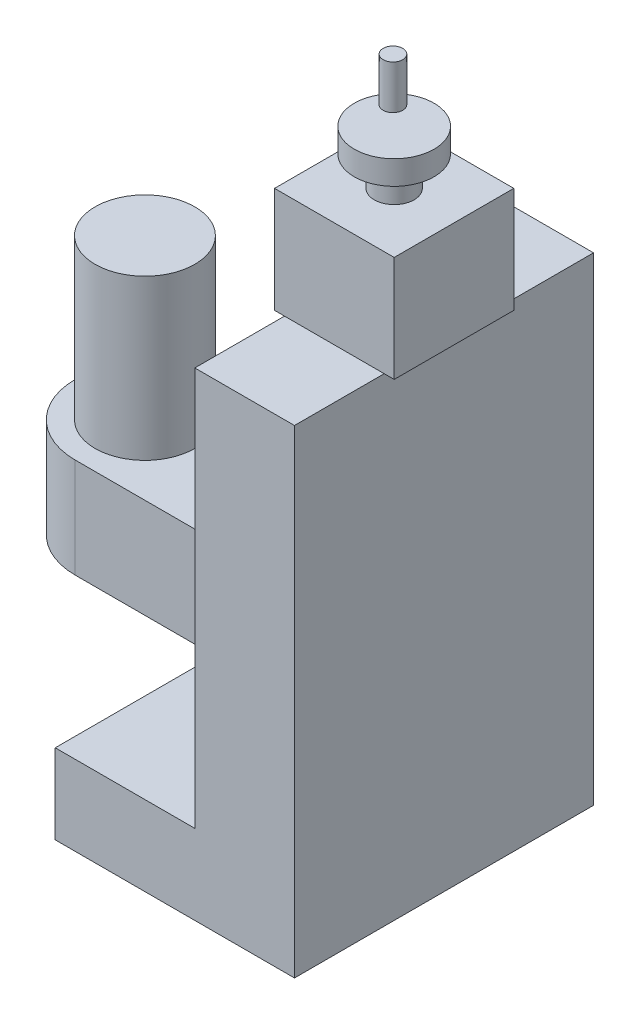
ISO-10303-21;
HEADER;
FILE_DESCRIPTION(('STEP AP214'),'2;1');
FILE_NAME('part.step','',(''),(''),'','','');
FILE_SCHEMA(('AUTOMOTIVE_DESIGN { 1 0 10303 214 1 1 1 1 }'));
ENDSEC;
DATA;
#1=APPLICATION_CONTEXT('core data for automotive mechanical design processes');
#2=APPLICATION_PROTOCOL_DEFINITION('international standard','automotive_design',2000,#1);
#3=PRODUCT_CONTEXT('',#1,'mechanical');
#4=PRODUCT('Part','Part','',(#3));
#5=PRODUCT_RELATED_PRODUCT_CATEGORY('part','',(#4));
#6=PRODUCT_DEFINITION_FORMATION('','',#4);
#7=PRODUCT_DEFINITION_CONTEXT('part definition',#1,'design');
#8=PRODUCT_DEFINITION('design','',#6,#7);
#9=PRODUCT_DEFINITION_SHAPE('','',#8);
#10=(LENGTH_UNIT() NAMED_UNIT(*) SI_UNIT(.MILLI.,.METRE.));
#11=(NAMED_UNIT(*) PLANE_ANGLE_UNIT() SI_UNIT($,.RADIAN.));
#12=(NAMED_UNIT(*) SI_UNIT($,.STERADIAN.) SOLID_ANGLE_UNIT());
#13=UNCERTAINTY_MEASURE_WITH_UNIT(LENGTH_MEASURE(1.E-05),#10,'distance_accuracy_value','');
#14=(GEOMETRIC_REPRESENTATION_CONTEXT(3) GLOBAL_UNCERTAINTY_ASSIGNED_CONTEXT((#13)) GLOBAL_UNIT_ASSIGNED_CONTEXT((#10,
#11,#12)) REPRESENTATION_CONTEXT('',''));
#15=CARTESIAN_POINT('',(0.,0.,0.));
#16=DIRECTION('',(0.,0.,1.));
#17=DIRECTION('',(1.,0.,0.));
#18=AXIS2_PLACEMENT_3D('',#15,#16,#17);
#19=CARTESIAN_POINT('',(70.,240.,150.));
#20=DIRECTION('',(0.,-1.,0.));
#21=DIRECTION('',(0.,0.,-1.));
#22=AXIS2_PLACEMENT_3D('',#19,#20,#21);
#23=PLANE('',#22);
#24=DIRECTION('',(-1.,0.,0.));
#25=VECTOR('',#24,1.);
#26=CARTESIAN_POINT('',(65.,240.,45.));
#27=LINE('',#26,#25);
#28=CARTESIAN_POINT('',(120.,240.,45.));
#29=VERTEX_POINT('',#28);
#30=CARTESIAN_POINT('',(70.,240.,45.));
#31=VERTEX_POINT('',#30);
#32=EDGE_CURVE('E46',#29,#31,#27,.T.);
#33=ORIENTED_EDGE('',*,*,#32,.F.);
#34=DIRECTION('',(0.,0.,-1.));
#35=VECTOR('',#34,1.);
#36=CARTESIAN_POINT('',(120.,240.,150.));
#37=LINE('',#36,#35);
#38=CARTESIAN_POINT('',(120.,240.,0.));
#39=VERTEX_POINT('',#38);
#40=EDGE_CURVE('E253',#29,#39,#37,.T.);
#41=ORIENTED_EDGE('',*,*,#40,.T.);
#42=DIRECTION('',(-1.,0.,0.));
#43=VECTOR('',#42,1.);
#44=CARTESIAN_POINT('',(70.,240.,0.));
#45=LINE('',#44,#43);
#46=CARTESIAN_POINT('',(70.,240.,0.));
#47=VERTEX_POINT('',#46);
#48=EDGE_CURVE('E240',#39,#47,#45,.T.);
#49=ORIENTED_EDGE('',*,*,#48,.T.);
#50=DIRECTION('',(0.,0.,-1.));
#51=VECTOR('',#50,1.);
#52=CARTESIAN_POINT('',(70.,240.,150.));
#53=LINE('',#52,#51);
#54=EDGE_CURVE('E58',#31,#47,#53,.T.);
#55=ORIENTED_EDGE('',*,*,#54,.F.);
#56=EDGE_LOOP('',(#33,#41,#49,#55));
#57=FACE_BOUND('',#56,.T.);
#58=ADVANCED_FACE('F37',(#57),#23,.F.);
#59=DIRECTION('',(1.,0.,0.));
#60=VECTOR('',#59,1.);
#61=CARTESIAN_POINT('',(65.,240.,105.));
#62=LINE('',#61,#60);
#63=CARTESIAN_POINT('',(70.,240.,105.));
#64=VERTEX_POINT('',#63);
#65=CARTESIAN_POINT('',(120.,240.,105.));
#66=VERTEX_POINT('',#65);
#67=EDGE_CURVE('E264',#64,#66,#62,.T.);
#68=ORIENTED_EDGE('',*,*,#67,.F.);
#69=CARTESIAN_POINT('',(70.,240.,150.));
#70=VERTEX_POINT('',#69);
#71=EDGE_CURVE('E250',#70,#64,#53,.T.);
#72=ORIENTED_EDGE('',*,*,#71,.F.);
#73=DIRECTION('',(-1.,0.,0.));
#74=VECTOR('',#73,1.);
#75=CARTESIAN_POINT('',(70.,240.,150.));
#76=LINE('',#75,#74);
#77=CARTESIAN_POINT('',(120.,240.,150.));
#78=VERTEX_POINT('',#77);
#79=EDGE_CURVE('E226',#78,#70,#76,.T.);
#80=ORIENTED_EDGE('',*,*,#79,.F.);
#81=EDGE_CURVE('E255',#78,#66,#37,.T.);
#82=ORIENTED_EDGE('',*,*,#81,.T.);
#83=EDGE_LOOP('',(#68,#72,#80,#82));
#84=FACE_BOUND('',#83,.T.);
#85=ADVANCED_FACE('F325',(#84),#23,.F.);
#86=CARTESIAN_POINT('',(0.,0.,150.));
#87=DIRECTION('',(1.,0.,0.));
#88=DIRECTION('',(0.,1.,0.));
#89=AXIS2_PLACEMENT_3D('',#86,#87,#88);
#90=PLANE('',#89);
#91=DIRECTION('',(0.,-1.,0.));
#92=VECTOR('',#91,1.);
#93=CARTESIAN_POINT('',(0.,0.,0.));
#94=LINE('',#93,#92);
#95=CARTESIAN_POINT('',(0.,40.,0.));
#96=VERTEX_POINT('',#95);
#97=CARTESIAN_POINT('',(0.,0.,0.));
#98=VERTEX_POINT('',#97);
#99=EDGE_CURVE('E217',#96,#98,#94,.T.);
#100=ORIENTED_EDGE('',*,*,#99,.T.);
#101=DIRECTION('',(0.,0.,-1.));
#102=VECTOR('',#101,1.);
#103=CARTESIAN_POINT('',(0.,0.,150.));
#104=LINE('',#103,#102);
#105=CARTESIAN_POINT('',(0.,0.,150.));
#106=VERTEX_POINT('',#105);
#107=EDGE_CURVE('E41',#106,#98,#104,.T.);
#108=ORIENTED_EDGE('',*,*,#107,.F.);
#109=DIRECTION('',(0.,-1.,0.));
#110=VECTOR('',#109,1.);
#111=CARTESIAN_POINT('',(0.,0.,150.));
#112=LINE('',#111,#110);
#113=CARTESIAN_POINT('',(0.,40.,150.));
#114=VERTEX_POINT('',#113);
#115=EDGE_CURVE('E218',#114,#106,#112,.T.);
#116=ORIENTED_EDGE('',*,*,#115,.F.);
#117=DIRECTION('',(0.,0.,-1.));
#118=VECTOR('',#117,1.);
#119=CARTESIAN_POINT('',(0.,40.,150.));
#120=LINE('',#119,#118);
#121=EDGE_CURVE('E232',#114,#96,#120,.T.);
#122=ORIENTED_EDGE('',*,*,#121,.T.);
#123=EDGE_LOOP('',(#100,#108,#116,#122));
#124=FACE_BOUND('',#123,.T.);
#125=ADVANCED_FACE('F39',(#124),#90,.F.);
#126=CARTESIAN_POINT('',(0.,0.,150.));
#127=DIRECTION('',(0.,1.,0.));
#128=DIRECTION('',(0.,0.,1.));
#129=AXIS2_PLACEMENT_3D('',#126,#127,#128);
#130=PLANE('',#129);
#131=DIRECTION('',(1.,0.,0.));
#132=VECTOR('',#131,1.);
#133=CARTESIAN_POINT('',(0.,0.,0.));
#134=LINE('',#133,#132);
#135=CARTESIAN_POINT('',(120.,0.,0.));
#136=VERTEX_POINT('',#135);
#137=EDGE_CURVE('E235',#98,#136,#134,.T.);
#138=ORIENTED_EDGE('',*,*,#137,.T.);
#139=DIRECTION('',(0.,0.,-1.));
#140=VECTOR('',#139,1.);
#141=CARTESIAN_POINT('',(120.,0.,150.));
#142=LINE('',#141,#140);
#143=CARTESIAN_POINT('',(120.,0.,150.));
#144=VERTEX_POINT('',#143);
#145=EDGE_CURVE('E256',#144,#136,#142,.T.);
#146=ORIENTED_EDGE('',*,*,#145,.F.);
#147=DIRECTION('',(1.,0.,0.));
#148=VECTOR('',#147,1.);
#149=CARTESIAN_POINT('',(0.,0.,150.));
#150=LINE('',#149,#148);
#151=EDGE_CURVE('E221',#106,#144,#150,.T.);
#152=ORIENTED_EDGE('',*,*,#151,.F.);
#153=ORIENTED_EDGE('',*,*,#107,.T.);
#154=EDGE_LOOP('',(#138,#146,#152,#153));
#155=FACE_BOUND('',#154,.T.);
#156=ADVANCED_FACE('F337',(#155),#130,.F.);
#157=CARTESIAN_POINT('',(120.,0.,150.));
#158=DIRECTION('',(-1.,0.,0.));
#159=DIRECTION('',(0.,0.,1.));
#160=AXIS2_PLACEMENT_3D('',#157,#158,#159);
#161=PLANE('',#160);
#162=DIRECTION('',(0.,1.,0.));
#163=VECTOR('',#162,1.);
#164=CARTESIAN_POINT('',(120.,0.,0.));
#165=LINE('',#164,#163);
#166=EDGE_CURVE('E237',#136,#39,#165,.T.);
#167=ORIENTED_EDGE('',*,*,#166,.T.);
#168=ORIENTED_EDGE('',*,*,#40,.F.);
#169=EDGE_CURVE('E257',#66,#29,#37,.T.);
#170=ORIENTED_EDGE('',*,*,#169,.F.);
#171=ORIENTED_EDGE('',*,*,#81,.F.);
#172=DIRECTION('',(0.,1.,0.));
#173=VECTOR('',#172,1.);
#174=CARTESIAN_POINT('',(120.,0.,150.));
#175=LINE('',#174,#173);
#176=EDGE_CURVE('E224',#144,#78,#175,.T.);
#177=ORIENTED_EDGE('',*,*,#176,.F.);
#178=ORIENTED_EDGE('',*,*,#145,.T.);
#179=EDGE_LOOP('',(#167,#168,#170,#171,#177,#178));
#180=FACE_BOUND('',#179,.T.);
#181=ADVANCED_FACE('F335',(#180),#161,.F.);
#182=CARTESIAN_POINT('',(70.,240.,150.));
#183=DIRECTION('',(1.,0.,0.));
#184=DIRECTION('',(0.,1.,0.));
#185=AXIS2_PLACEMENT_3D('',#182,#183,#184);
#186=PLANE('',#185);
#187=DIRECTION('',(0.,-1.,0.));
#188=VECTOR('',#187,1.);
#189=CARTESIAN_POINT('',(70.,130.,40.));
#190=LINE('',#189,#188);
#191=CARTESIAN_POINT('',(70.,130.,40.));
#192=VERTEX_POINT('',#191);
#193=CARTESIAN_POINT('',(70.,80.,40.));
#194=VERTEX_POINT('',#193);
#195=EDGE_CURVE('E214',#192,#194,#190,.T.);
#196=ORIENTED_EDGE('',*,*,#195,.F.);
#197=DIRECTION('',(0.,0.,-1.));
#198=VECTOR('',#197,1.);
#199=CARTESIAN_POINT('',(70.,130.,40.));
#200=LINE('',#199,#198);
#201=CARTESIAN_POINT('',(70.,130.,110.));
#202=VERTEX_POINT('',#201);
#203=EDGE_CURVE('E188',#202,#192,#200,.T.);
#204=ORIENTED_EDGE('',*,*,#203,.F.);
#205=DIRECTION('',(0.,-1.,0.));
#206=VECTOR('',#205,1.);
#207=CARTESIAN_POINT('',(70.,130.,110.));
#208=LINE('',#207,#206);
#209=CARTESIAN_POINT('',(70.,80.,110.));
#210=VERTEX_POINT('',#209);
#211=EDGE_CURVE('E199',#202,#210,#208,.T.);
#212=ORIENTED_EDGE('',*,*,#211,.T.);
#213=DIRECTION('',(0.,0.,-1.));
#214=VECTOR('',#213,1.);
#215=CARTESIAN_POINT('',(70.,80.,40.));
#216=LINE('',#215,#214);
#217=EDGE_CURVE('E186',#210,#194,#216,.T.);
#218=ORIENTED_EDGE('',*,*,#217,.T.);
#219=EDGE_LOOP('',(#196,#204,#212,#218));
#220=FACE_BOUND('',#219,.T.);
#221=DIRECTION('',(0.,-1.,0.));
#222=VECTOR('',#221,1.);
#223=CARTESIAN_POINT('',(70.,240.,0.));
#224=LINE('',#223,#222);
#225=CARTESIAN_POINT('',(70.,40.,0.));
#226=VERTEX_POINT('',#225);
#227=EDGE_CURVE('E242',#47,#226,#224,.T.);
#228=ORIENTED_EDGE('',*,*,#227,.T.);
#229=DIRECTION('',(0.,0.,-1.));
#230=VECTOR('',#229,1.);
#231=CARTESIAN_POINT('',(70.,40.,150.));
#232=LINE('',#231,#230);
#233=CARTESIAN_POINT('',(70.,40.,150.));
#234=VERTEX_POINT('',#233);
#235=EDGE_CURVE('E247',#234,#226,#232,.T.);
#236=ORIENTED_EDGE('',*,*,#235,.F.);
#237=DIRECTION('',(0.,-1.,0.));
#238=VECTOR('',#237,1.);
#239=CARTESIAN_POINT('',(70.,240.,150.));
#240=LINE('',#239,#238);
#241=EDGE_CURVE('E228',#70,#234,#240,.T.);
#242=ORIENTED_EDGE('',*,*,#241,.F.);
#243=ORIENTED_EDGE('',*,*,#71,.T.);
#244=EDGE_CURVE('E254',#64,#31,#53,.T.);
#245=ORIENTED_EDGE('',*,*,#244,.T.);
#246=ORIENTED_EDGE('',*,*,#54,.T.);
#247=EDGE_LOOP('',(#228,#236,#242,#243,#245,#246));
#248=FACE_BOUND('',#247,.T.);
#249=ADVANCED_FACE('F333',(#220,#248),#186,.F.);
#250=CARTESIAN_POINT('',(0.,40.,150.));
#251=DIRECTION('',(0.,-1.,0.));
#252=DIRECTION('',(0.,0.,-1.));
#253=AXIS2_PLACEMENT_3D('',#250,#251,#252);
#254=PLANE('',#253);
#255=DIRECTION('',(-1.,0.,0.));
#256=VECTOR('',#255,1.);
#257=CARTESIAN_POINT('',(0.,40.,0.));
#258=LINE('',#257,#256);
#259=EDGE_CURVE('E222',#226,#96,#258,.T.);
#260=ORIENTED_EDGE('',*,*,#259,.T.);
#261=ORIENTED_EDGE('',*,*,#121,.F.);
#262=DIRECTION('',(-1.,0.,0.));
#263=VECTOR('',#262,1.);
#264=CARTESIAN_POINT('',(0.,40.,150.));
#265=LINE('',#264,#263);
#266=EDGE_CURVE('E230',#234,#114,#265,.T.);
#267=ORIENTED_EDGE('',*,*,#266,.F.);
#268=ORIENTED_EDGE('',*,*,#235,.T.);
#269=EDGE_LOOP('',(#260,#261,#267,#268));
#270=FACE_BOUND('',#269,.T.);
#271=ADVANCED_FACE('F370',(#270),#254,.F.);
#272=CARTESIAN_POINT('',(0.,0.,150.));
#273=DIRECTION('',(0.,0.,-1.));
#274=DIRECTION('',(-1.,0.,0.));
#275=AXIS2_PLACEMENT_3D('',#272,#273,#274);
#276=PLANE('',#275);
#277=ORIENTED_EDGE('',*,*,#115,.T.);
#278=ORIENTED_EDGE('',*,*,#151,.T.);
#279=ORIENTED_EDGE('',*,*,#176,.T.);
#280=ORIENTED_EDGE('',*,*,#79,.T.);
#281=ORIENTED_EDGE('',*,*,#241,.T.);
#282=ORIENTED_EDGE('',*,*,#266,.T.);
#283=EDGE_LOOP('',(#277,#278,#279,#280,#281,#282));
#284=FACE_BOUND('',#283,.T.);
#285=ADVANCED_FACE('F374',(#284),#276,.F.);
#286=CARTESIAN_POINT('',(0.,0.,0.));
#287=DIRECTION('',(0.,0.,-1.));
#288=DIRECTION('',(-1.,0.,0.));
#289=AXIS2_PLACEMENT_3D('',#286,#287,#288);
#290=PLANE('',#289);
#291=ORIENTED_EDGE('',*,*,#99,.F.);
#292=ORIENTED_EDGE('',*,*,#259,.F.);
#293=ORIENTED_EDGE('',*,*,#227,.F.);
#294=ORIENTED_EDGE('',*,*,#48,.F.);
#295=ORIENTED_EDGE('',*,*,#166,.F.);
#296=ORIENTED_EDGE('',*,*,#137,.F.);
#297=EDGE_LOOP('',(#291,#292,#293,#294,#295,#296));
#298=FACE_BOUND('',#297,.T.);
#299=ADVANCED_FACE('F345',(#298),#290,.T.);
#300=CARTESIAN_POINT('',(70.,130.,40.));
#301=DIRECTION('',(0.,0.,1.));
#302=DIRECTION('',(1.,0.,0.));
#303=AXIS2_PLACEMENT_3D('',#300,#301,#302);
#304=PLANE('',#303);
#305=DIRECTION('',(-1.,0.,0.));
#306=VECTOR('',#305,1.);
#307=CARTESIAN_POINT('',(70.,80.,40.));
#308=LINE('',#307,#306);
#309=CARTESIAN_POINT('',(-30.,80.,40.));
#310=VERTEX_POINT('',#309);
#311=EDGE_CURVE('E201',#194,#310,#308,.T.);
#312=ORIENTED_EDGE('',*,*,#311,.T.);
#313=DIRECTION('',(0.,-1.,0.));
#314=VECTOR('',#313,1.);
#315=CARTESIAN_POINT('',(-30.,130.,40.));
#316=LINE('',#315,#314);
#317=CARTESIAN_POINT('',(-30.,130.,40.));
#318=VERTEX_POINT('',#317);
#319=EDGE_CURVE('E211',#318,#310,#316,.T.);
#320=ORIENTED_EDGE('',*,*,#319,.F.);
#321=DIRECTION('',(-1.,0.,0.));
#322=VECTOR('',#321,1.);
#323=CARTESIAN_POINT('',(70.,130.,40.));
#324=LINE('',#323,#322);
#325=EDGE_CURVE('E191',#192,#318,#324,.T.);
#326=ORIENTED_EDGE('',*,*,#325,.F.);
#327=ORIENTED_EDGE('',*,*,#195,.T.);
#328=EDGE_LOOP('',(#312,#320,#326,#327));
#329=FACE_BOUND('',#328,.T.);
#330=ADVANCED_FACE('F384',(#329),#304,.F.);
#331=CARTESIAN_POINT('',(-30.,130.,75.));
#332=DIRECTION('',(0.,-1.,0.));
#333=DIRECTION('',(0.,0.,-1.));
#334=AXIS2_PLACEMENT_3D('',#331,#332,#333);
#335=CYLINDRICAL_SURFACE('',#334,35.);
#336=CARTESIAN_POINT('',(-30.,80.,75.));
#337=DIRECTION('',(0.,1.,0.));
#338=DIRECTION('',(0.,0.,1.));
#339=AXIS2_PLACEMENT_3D('',#336,#337,#338);
#340=CIRCLE('',#339,35.);
#341=CARTESIAN_POINT('',(-30.,80.,110.));
#342=VERTEX_POINT('',#341);
#343=EDGE_CURVE('E203',#310,#342,#340,.T.);
#344=ORIENTED_EDGE('',*,*,#343,.T.);
#345=DIRECTION('',(0.,-1.,0.));
#346=VECTOR('',#345,1.);
#347=CARTESIAN_POINT('',(-30.,130.,110.));
#348=LINE('',#347,#346);
#349=CARTESIAN_POINT('',(-30.,130.,110.));
#350=VERTEX_POINT('',#349);
#351=EDGE_CURVE('E208',#350,#342,#348,.T.);
#352=ORIENTED_EDGE('',*,*,#351,.F.);
#353=CARTESIAN_POINT('',(-30.,130.,75.));
#354=DIRECTION('',(0.,1.,0.));
#355=DIRECTION('',(0.,0.,1.));
#356=AXIS2_PLACEMENT_3D('',#353,#354,#355);
#357=CIRCLE('',#356,35.);
#358=EDGE_CURVE('E194',#318,#350,#357,.T.);
#359=ORIENTED_EDGE('',*,*,#358,.F.);
#360=ORIENTED_EDGE('',*,*,#319,.T.);
#361=EDGE_LOOP('',(#344,#352,#359,#360));
#362=FACE_BOUND('',#361,.T.);
#363=ADVANCED_FACE('F389',(#362),#335,.T.);
#364=CARTESIAN_POINT('',(70.,130.,110.));
#365=DIRECTION('',(0.,0.,-1.));
#366=DIRECTION('',(-1.,0.,0.));
#367=AXIS2_PLACEMENT_3D('',#364,#365,#366);
#368=PLANE('',#367);
#369=DIRECTION('',(1.,0.,0.));
#370=VECTOR('',#369,1.);
#371=CARTESIAN_POINT('',(70.,80.,110.));
#372=LINE('',#371,#370);
#373=EDGE_CURVE('E192',#342,#210,#372,.T.);
#374=ORIENTED_EDGE('',*,*,#373,.T.);
#375=ORIENTED_EDGE('',*,*,#211,.F.);
#376=DIRECTION('',(1.,0.,0.));
#377=VECTOR('',#376,1.);
#378=CARTESIAN_POINT('',(70.,130.,110.));
#379=LINE('',#378,#377);
#380=EDGE_CURVE('E196',#350,#202,#379,.T.);
#381=ORIENTED_EDGE('',*,*,#380,.F.);
#382=ORIENTED_EDGE('',*,*,#351,.T.);
#383=EDGE_LOOP('',(#374,#375,#381,#382));
#384=FACE_BOUND('',#383,.T.);
#385=ADVANCED_FACE('F393',(#384),#368,.F.);
#386=CARTESIAN_POINT('',(-30.,130.,75.));
#387=DIRECTION('',(0.,1.,0.));
#388=DIRECTION('',(0.,0.,1.));
#389=AXIS2_PLACEMENT_3D('',#386,#387,#388);
#390=PLANE('',#389);
#391=CARTESIAN_POINT('',(-29.9999970220869,130.,75.));
#392=DIRECTION('',(0.,1.,0.));
#393=DIRECTION('',(0.,0.,1.));
#394=AXIS2_PLACEMENT_3D('',#391,#392,#393);
#395=CIRCLE('',#394,25.);
#396=CARTESIAN_POINT('',(-29.9999970220869,130.,100.));
#397=VERTEX_POINT('',#396);
#398=EDGE_CURVE('E176',#397,#397,#395,.T.);
#399=ORIENTED_EDGE('',*,*,#398,.F.);
#400=EDGE_LOOP('',(#399));
#401=FACE_BOUND('',#400,.T.);
#402=ORIENTED_EDGE('',*,*,#203,.T.);
#403=ORIENTED_EDGE('',*,*,#325,.T.);
#404=ORIENTED_EDGE('',*,*,#358,.T.);
#405=ORIENTED_EDGE('',*,*,#380,.T.);
#406=EDGE_LOOP('',(#402,#403,#404,#405));
#407=FACE_BOUND('',#406,.T.);
#408=ADVANCED_FACE('F397',(#401,#407),#390,.T.);
#409=CARTESIAN_POINT('',(-30.,80.,75.));
#410=DIRECTION('',(0.,1.,0.));
#411=DIRECTION('',(0.,0.,1.));
#412=AXIS2_PLACEMENT_3D('',#409,#410,#411);
#413=PLANE('',#412);
#414=ORIENTED_EDGE('',*,*,#217,.F.);
#415=ORIENTED_EDGE('',*,*,#373,.F.);
#416=ORIENTED_EDGE('',*,*,#343,.F.);
#417=ORIENTED_EDGE('',*,*,#311,.F.);
#418=EDGE_LOOP('',(#414,#415,#416,#417));
#419=FACE_BOUND('',#418,.T.);
#420=ADVANCED_FACE('F399',(#419),#413,.F.);
#421=CARTESIAN_POINT('',(-29.9999970220869,210.,75.));
#422=DIRECTION('',(0.,-1.,0.));
#423=DIRECTION('',(0.,0.,-1.));
#424=AXIS2_PLACEMENT_3D('',#421,#422,#423);
#425=CYLINDRICAL_SURFACE('',#424,25.);
#426=CARTESIAN_POINT('',(-29.9999970220869,210.,75.));
#427=DIRECTION('',(0.,1.,0.));
#428=DIRECTION('',(0.,0.,1.));
#429=AXIS2_PLACEMENT_3D('',#426,#427,#428);
#430=CIRCLE('',#429,25.);
#431=CARTESIAN_POINT('',(-29.9999970220869,210.,100.));
#432=VERTEX_POINT('',#431);
#433=EDGE_CURVE('E179',#432,#432,#430,.T.);
#434=ORIENTED_EDGE('',*,*,#433,.F.);
#435=EDGE_LOOP('',(#434));
#436=FACE_BOUND('',#435,.T.);
#437=ORIENTED_EDGE('',*,*,#398,.T.);
#438=EDGE_LOOP('',(#437));
#439=FACE_BOUND('',#438,.T.);
#440=ADVANCED_FACE('F402',(#436,#439),#425,.T.);
#441=CARTESIAN_POINT('',(-29.9999970220869,210.,75.));
#442=DIRECTION('',(0.,1.,0.));
#443=DIRECTION('',(0.,0.,1.));
#444=AXIS2_PLACEMENT_3D('',#441,#442,#443);
#445=PLANE('',#444);
#446=ORIENTED_EDGE('',*,*,#433,.T.);
#447=EDGE_LOOP('',(#446));
#448=FACE_BOUND('',#447,.T.);
#449=ADVANCED_FACE('F409',(#448),#445,.T.);
#450=CARTESIAN_POINT('',(0.,240.,0.));
#451=DIRECTION('',(0.,1.,0.));
#452=DIRECTION('',(0.,0.,1.));
#453=AXIS2_PLACEMENT_3D('',#450,#451,#452);
#454=PLANE('',#453);
#455=CARTESIAN_POINT('',(125.,240.,105.));
#456=VERTEX_POINT('',#455);
#457=EDGE_CURVE('E270',#66,#456,#62,.T.);
#458=ORIENTED_EDGE('',*,*,#457,.F.);
#459=ORIENTED_EDGE('',*,*,#169,.T.);
#460=CARTESIAN_POINT('',(125.,240.,45.));
#461=VERTEX_POINT('',#460);
#462=EDGE_CURVE('E171',#461,#29,#27,.T.);
#463=ORIENTED_EDGE('',*,*,#462,.F.);
#464=DIRECTION('',(0.,0.,-1.));
#465=VECTOR('',#464,1.);
#466=CARTESIAN_POINT('',(125.,240.,45.));
#467=LINE('',#466,#465);
#468=EDGE_CURVE('E275',#456,#461,#467,.T.);
#469=ORIENTED_EDGE('',*,*,#468,.F.);
#470=EDGE_LOOP('',(#458,#459,#463,#469));
#471=FACE_BOUND('',#470,.T.);
#472=ADVANCED_FACE('F355',(#471),#454,.F.);
#473=CARTESIAN_POINT('',(65.,293.,45.));
#474=DIRECTION('',(1.,0.,0.));
#475=DIRECTION('',(0.,0.,-1.));
#476=AXIS2_PLACEMENT_3D('',#473,#474,#475);
#477=PLANE('',#476);
#478=DIRECTION('',(0.,0.,1.));
#479=VECTOR('',#478,1.);
#480=CARTESIAN_POINT('',(65.,240.,45.));
#481=LINE('',#480,#479);
#482=CARTESIAN_POINT('',(65.,240.,45.));
#483=VERTEX_POINT('',#482);
#484=CARTESIAN_POINT('',(65.,240.,105.));
#485=VERTEX_POINT('',#484);
#486=EDGE_CURVE('E175',#483,#485,#481,.T.);
#487=ORIENTED_EDGE('',*,*,#486,.T.);
#488=DIRECTION('',(0.,-1.,0.));
#489=VECTOR('',#488,1.);
#490=CARTESIAN_POINT('',(65.,293.,105.));
#491=LINE('',#490,#489);
#492=CARTESIAN_POINT('',(65.,293.,105.));
#493=VERTEX_POINT('',#492);
#494=EDGE_CURVE('E155',#493,#485,#491,.T.);
#495=ORIENTED_EDGE('',*,*,#494,.F.);
#496=DIRECTION('',(0.,0.,1.));
#497=VECTOR('',#496,1.);
#498=CARTESIAN_POINT('',(65.,293.,45.));
#499=LINE('',#498,#497);
#500=CARTESIAN_POINT('',(65.,293.,45.));
#501=VERTEX_POINT('',#500);
#502=EDGE_CURVE('E162',#501,#493,#499,.T.);
#503=ORIENTED_EDGE('',*,*,#502,.F.);
#504=DIRECTION('',(0.,-1.,0.));
#505=VECTOR('',#504,1.);
#506=CARTESIAN_POINT('',(65.,293.,45.));
#507=LINE('',#506,#505);
#508=EDGE_CURVE('E283',#501,#483,#507,.T.);
#509=ORIENTED_EDGE('',*,*,#508,.T.);
#510=EDGE_LOOP('',(#487,#495,#503,#509));
#511=FACE_BOUND('',#510,.T.);
#512=ADVANCED_FACE('F173',(#511),#477,.F.);
#513=CARTESIAN_POINT('',(65.,293.,105.));
#514=DIRECTION('',(0.,0.,-1.));
#515=DIRECTION('',(-1.,0.,0.));
#516=AXIS2_PLACEMENT_3D('',#513,#514,#515);
#517=PLANE('',#516);
#518=EDGE_CURVE('E269',#485,#64,#62,.T.);
#519=ORIENTED_EDGE('',*,*,#518,.T.);
#520=ORIENTED_EDGE('',*,*,#67,.T.);
#521=ORIENTED_EDGE('',*,*,#457,.T.);
#522=DIRECTION('',(0.,-1.,0.));
#523=VECTOR('',#522,1.);
#524=CARTESIAN_POINT('',(125.,293.,105.));
#525=LINE('',#524,#523);
#526=CARTESIAN_POINT('',(125.,293.,105.));
#527=VERTEX_POINT('',#526);
#528=EDGE_CURVE('E158',#527,#456,#525,.T.);
#529=ORIENTED_EDGE('',*,*,#528,.F.);
#530=DIRECTION('',(1.,0.,0.));
#531=VECTOR('',#530,1.);
#532=CARTESIAN_POINT('',(65.,293.,105.));
#533=LINE('',#532,#531);
#534=EDGE_CURVE('E150',#493,#527,#533,.T.);
#535=ORIENTED_EDGE('',*,*,#534,.F.);
#536=ORIENTED_EDGE('',*,*,#494,.T.);
#537=EDGE_LOOP('',(#519,#520,#521,#529,#535,#536));
#538=FACE_BOUND('',#537,.T.);
#539=ADVANCED_FACE('F153',(#538),#517,.F.);
#540=CARTESIAN_POINT('',(125.,293.,45.));
#541=DIRECTION('',(-1.,0.,0.));
#542=DIRECTION('',(0.,0.,1.));
#543=AXIS2_PLACEMENT_3D('',#540,#541,#542);
#544=PLANE('',#543);
#545=ORIENTED_EDGE('',*,*,#468,.T.);
#546=DIRECTION('',(0.,-1.,0.));
#547=VECTOR('',#546,1.);
#548=CARTESIAN_POINT('',(125.,293.,45.));
#549=LINE('',#548,#547);
#550=CARTESIAN_POINT('',(125.,293.,45.));
#551=VERTEX_POINT('',#550);
#552=EDGE_CURVE('E181',#551,#461,#549,.T.);
#553=ORIENTED_EDGE('',*,*,#552,.F.);
#554=DIRECTION('',(0.,0.,-1.));
#555=VECTOR('',#554,1.);
#556=CARTESIAN_POINT('',(125.,293.,45.));
#557=LINE('',#556,#555);
#558=EDGE_CURVE('E161',#527,#551,#557,.T.);
#559=ORIENTED_EDGE('',*,*,#558,.F.);
#560=ORIENTED_EDGE('',*,*,#528,.T.);
#561=EDGE_LOOP('',(#545,#553,#559,#560));
#562=FACE_BOUND('',#561,.T.);
#563=ADVANCED_FACE('F418',(#562),#544,.F.);
#564=CARTESIAN_POINT('',(65.,293.,45.));
#565=DIRECTION('',(0.,0.,1.));
#566=DIRECTION('',(1.,0.,0.));
#567=AXIS2_PLACEMENT_3D('',#564,#565,#566);
#568=PLANE('',#567);
#569=ORIENTED_EDGE('',*,*,#462,.T.);
#570=ORIENTED_EDGE('',*,*,#32,.T.);
#571=EDGE_CURVE('E272',#31,#483,#27,.T.);
#572=ORIENTED_EDGE('',*,*,#571,.T.);
#573=ORIENTED_EDGE('',*,*,#508,.F.);
#574=DIRECTION('',(-1.,0.,0.));
#575=VECTOR('',#574,1.);
#576=CARTESIAN_POINT('',(65.,293.,45.));
#577=LINE('',#576,#575);
#578=EDGE_CURVE('E167',#551,#501,#577,.T.);
#579=ORIENTED_EDGE('',*,*,#578,.F.);
#580=ORIENTED_EDGE('',*,*,#552,.T.);
#581=EDGE_LOOP('',(#569,#570,#572,#573,#579,#580));
#582=FACE_BOUND('',#581,.T.);
#583=ADVANCED_FACE('F359',(#582),#568,.F.);
#584=CARTESIAN_POINT('',(0.,293.,0.));
#585=DIRECTION('',(0.,1.,0.));
#586=DIRECTION('',(0.,0.,1.));
#587=AXIS2_PLACEMENT_3D('',#584,#585,#586);
#588=PLANE('',#587);
#589=CARTESIAN_POINT('',(95.,293.,75.));
#590=DIRECTION('',(0.,1.,0.));
#591=DIRECTION('',(0.,0.,1.));
#592=AXIS2_PLACEMENT_3D('',#589,#590,#591);
#593=CIRCLE('',#592,9.99999999999999);
#594=CARTESIAN_POINT('',(95.,293.,85.));
#595=VERTEX_POINT('',#594);
#596=EDGE_CURVE('E11',#595,#595,#593,.T.);
#597=ORIENTED_EDGE('',*,*,#596,.F.);
#598=EDGE_LOOP('',(#597));
#599=FACE_BOUND('',#598,.T.);
#600=ORIENTED_EDGE('',*,*,#502,.T.);
#601=ORIENTED_EDGE('',*,*,#534,.T.);
#602=ORIENTED_EDGE('',*,*,#558,.T.);
#603=ORIENTED_EDGE('',*,*,#578,.T.);
#604=EDGE_LOOP('',(#600,#601,#602,#603));
#605=FACE_BOUND('',#604,.T.);
#606=ADVANCED_FACE('F165',(#599,#605),#588,.T.);
#607=ORIENTED_EDGE('',*,*,#244,.F.);
#608=ORIENTED_EDGE('',*,*,#518,.F.);
#609=ORIENTED_EDGE('',*,*,#486,.F.);
#610=ORIENTED_EDGE('',*,*,#571,.F.);
#611=EDGE_LOOP('',(#607,#608,#609,#610));
#612=FACE_BOUND('',#611,.T.);
#613=ADVANCED_FACE('F365',(#612),#454,.F.);
#614=CARTESIAN_POINT('',(95.,308.,75.));
#615=DIRECTION('',(0.,-1.,0.));
#616=DIRECTION('',(0.,0.,-1.));
#617=AXIS2_PLACEMENT_3D('',#614,#615,#616);
#618=CYLINDRICAL_SURFACE('',#617,9.99999999999999);
#619=CARTESIAN_POINT('',(95.,308.,75.));
#620=DIRECTION('',(0.,1.,0.));
#621=DIRECTION('',(0.,0.,1.));
#622=AXIS2_PLACEMENT_3D('',#619,#620,#621);
#623=CIRCLE('',#622,9.99999999999999);
#624=CARTESIAN_POINT('',(95.,308.,85.));
#625=VERTEX_POINT('',#624);
#626=EDGE_CURVE('E277',#625,#625,#623,.T.);
#627=ORIENTED_EDGE('',*,*,#626,.F.);
#628=EDGE_LOOP('',(#627));
#629=FACE_BOUND('',#628,.T.);
#630=ORIENTED_EDGE('',*,*,#596,.T.);
#631=EDGE_LOOP('',(#630));
#632=FACE_BOUND('',#631,.T.);
#633=ADVANCED_FACE('F315',(#629,#632),#618,.T.);
#634=CARTESIAN_POINT('',(95.,320.,75.));
#635=DIRECTION('',(0.,-1.,0.));
#636=DIRECTION('',(0.,0.,-1.));
#637=AXIS2_PLACEMENT_3D('',#634,#635,#636);
#638=CYLINDRICAL_SURFACE('',#637,20.);
#639=CARTESIAN_POINT('',(95.,320.,75.));
#640=DIRECTION('',(0.,1.,0.));
#641=DIRECTION('',(0.,0.,1.));
#642=AXIS2_PLACEMENT_3D('',#639,#640,#641);
#643=CIRCLE('',#642,20.);
#644=CARTESIAN_POINT('',(95.,320.,95.));
#645=VERTEX_POINT('',#644);
#646=EDGE_CURVE('E279',#645,#645,#643,.T.);
#647=ORIENTED_EDGE('',*,*,#646,.F.);
#648=EDGE_LOOP('',(#647));
#649=FACE_BOUND('',#648,.T.);
#650=CARTESIAN_POINT('',(95.,308.,75.));
#651=DIRECTION('',(0.,1.,0.));
#652=DIRECTION('',(0.,0.,1.));
#653=AXIS2_PLACEMENT_3D('',#650,#651,#652);
#654=CIRCLE('',#653,20.);
#655=CARTESIAN_POINT('',(95.,308.,95.));
#656=VERTEX_POINT('',#655);
#657=EDGE_CURVE('E285',#656,#656,#654,.T.);
#658=ORIENTED_EDGE('',*,*,#657,.T.);
#659=EDGE_LOOP('',(#658));
#660=FACE_BOUND('',#659,.T.);
#661=ADVANCED_FACE('F309',(#649,#660),#638,.T.);
#662=CARTESIAN_POINT('',(95.,320.,75.));
#663=DIRECTION('',(0.,1.,0.));
#664=DIRECTION('',(0.,0.,1.));
#665=AXIS2_PLACEMENT_3D('',#662,#663,#664);
#666=PLANE('',#665);
#667=CARTESIAN_POINT('',(85.3283184076012,320.,65.9529591419554));
#668=DIRECTION('',(0.,1.,0.));
#669=DIRECTION('',(0.,0.,1.));
#670=AXIS2_PLACEMENT_3D('',#667,#668,#669);
#671=CIRCLE('',#670,4.91405477808434);
#672=CARTESIAN_POINT('',(85.3283184076012,320.,70.8670139200398));
#673=VERTEX_POINT('',#672);
#674=EDGE_CURVE('E291',#673,#673,#671,.T.);
#675=ORIENTED_EDGE('',*,*,#674,.F.);
#676=EDGE_LOOP('',(#675));
#677=FACE_BOUND('',#676,.T.);
#678=ORIENTED_EDGE('',*,*,#646,.T.);
#679=EDGE_LOOP('',(#678));
#680=FACE_BOUND('',#679,.T.);
#681=ADVANCED_FACE('F306',(#677,#680),#666,.T.);
#682=CARTESIAN_POINT('',(95.,308.,75.));
#683=DIRECTION('',(0.,1.,0.));
#684=DIRECTION('',(0.,0.,1.));
#685=AXIS2_PLACEMENT_3D('',#682,#683,#684);
#686=PLANE('',#685);
#687=ORIENTED_EDGE('',*,*,#626,.T.);
#688=EDGE_LOOP('',(#687));
#689=FACE_BOUND('',#688,.T.);
#690=ORIENTED_EDGE('',*,*,#657,.F.);
#691=EDGE_LOOP('',(#690));
#692=FACE_BOUND('',#691,.T.);
#693=ADVANCED_FACE('F302',(#689,#692),#686,.F.);
#694=CARTESIAN_POINT('',(85.3283184076012,342.,65.9529591419554));
#695=DIRECTION('',(0.,-1.,0.));
#696=DIRECTION('',(0.,0.,-1.));
#697=AXIS2_PLACEMENT_3D('',#694,#695,#696);
#698=CYLINDRICAL_SURFACE('',#697,4.91405477808434);
#699=CARTESIAN_POINT('',(85.3283184076012,342.,65.9529591419554));
#700=DIRECTION('',(0.,1.,0.));
#701=DIRECTION('',(0.,0.,1.));
#702=AXIS2_PLACEMENT_3D('',#699,#700,#701);
#703=CIRCLE('',#702,4.91405477808434);
#704=CARTESIAN_POINT('',(85.3283184076012,342.,70.8670139200398));
#705=VERTEX_POINT('',#704);
#706=EDGE_CURVE('E288',#705,#705,#703,.T.);
#707=ORIENTED_EDGE('',*,*,#706,.F.);
#708=EDGE_LOOP('',(#707));
#709=FACE_BOUND('',#708,.T.);
#710=ORIENTED_EDGE('',*,*,#674,.T.);
#711=EDGE_LOOP('',(#710));
#712=FACE_BOUND('',#711,.T.);
#713=ADVANCED_FACE('F299',(#709,#712),#698,.T.);
#714=CARTESIAN_POINT('',(85.3283184076012,342.,65.9529591419554));
#715=DIRECTION('',(0.,1.,0.));
#716=DIRECTION('',(0.,0.,1.));
#717=AXIS2_PLACEMENT_3D('',#714,#715,#716);
#718=PLANE('',#717);
#719=ORIENTED_EDGE('',*,*,#706,.T.);
#720=EDGE_LOOP('',(#719));
#721=FACE_BOUND('',#720,.T.);
#722=ADVANCED_FACE('F297',(#721),#718,.T.);
#723=CLOSED_SHELL('',(#58,#85,#125,#156,#181,#249,#271,#285,#299,#330,#363,#385,#408,#420,#440,
#449,#472,#512,#539,#563,#583,#606,#613,#633,#661,#681,#693,#713,#722));
#724=MANIFOLD_SOLID_BREP('B2',#723);
#725=ADVANCED_BREP_SHAPE_REPRESENTATION('',(#18,#724),#14);
#726=SHAPE_DEFINITION_REPRESENTATION(#9,#725);
ENDSEC;
END-ISO-10303-21;
